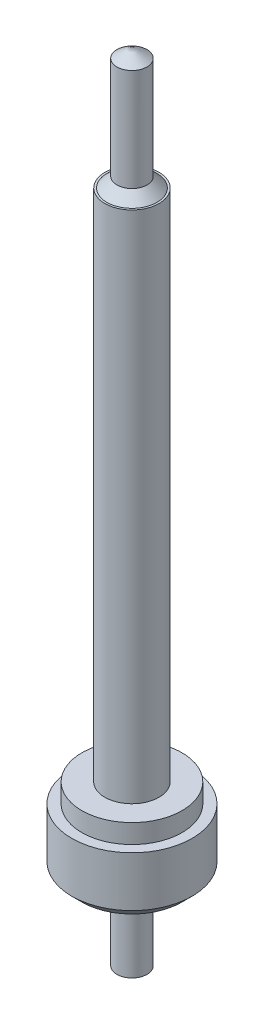
ISO-10303-21;
HEADER;
FILE_DESCRIPTION(('STEP AP214'),'2;1');
FILE_NAME('part.step','',(''),(''),'','','');
FILE_SCHEMA(('AUTOMOTIVE_DESIGN { 1 0 10303 214 1 1 1 1 }'));
ENDSEC;
DATA;
#1=APPLICATION_CONTEXT('core data for automotive mechanical design processes');
#2=APPLICATION_PROTOCOL_DEFINITION('international standard','automotive_design',2000,#1);
#3=PRODUCT_CONTEXT('',#1,'mechanical');
#4=PRODUCT('Part','Part','',(#3));
#5=PRODUCT_RELATED_PRODUCT_CATEGORY('part','',(#4));
#6=PRODUCT_DEFINITION_FORMATION('','',#4);
#7=PRODUCT_DEFINITION_CONTEXT('part definition',#1,'design');
#8=PRODUCT_DEFINITION('design','',#6,#7);
#9=PRODUCT_DEFINITION_SHAPE('','',#8);
#10=(LENGTH_UNIT() NAMED_UNIT(*) SI_UNIT(.MILLI.,.METRE.));
#11=(NAMED_UNIT(*) PLANE_ANGLE_UNIT() SI_UNIT($,.RADIAN.));
#12=(NAMED_UNIT(*) SI_UNIT($,.STERADIAN.) SOLID_ANGLE_UNIT());
#13=UNCERTAINTY_MEASURE_WITH_UNIT(LENGTH_MEASURE(1.E-05),#10,'distance_accuracy_value','');
#14=(GEOMETRIC_REPRESENTATION_CONTEXT(3) GLOBAL_UNCERTAINTY_ASSIGNED_CONTEXT((#13)) GLOBAL_UNIT_ASSIGNED_CONTEXT((#10,
#11,#12)) REPRESENTATION_CONTEXT('',''));
#15=CARTESIAN_POINT('',(0.,0.,0.));
#16=DIRECTION('',(0.,0.,1.));
#17=DIRECTION('',(1.,0.,0.));
#18=AXIS2_PLACEMENT_3D('',#15,#16,#17);
#19=CARTESIAN_POINT('',(0.,-0.3,0.));
#20=DIRECTION('',(0.,1.,0.));
#21=DIRECTION('',(0.,0.,1.));
#22=AXIS2_PLACEMENT_3D('',#19,#20,#21);
#23=CYLINDRICAL_SURFACE('',#22,0.3);
#24=CARTESIAN_POINT('',(0.,-0.25,0.));
#25=DIRECTION('',(0.,1.,0.));
#26=DIRECTION('',(0.,0.,1.));
#27=AXIS2_PLACEMENT_3D('',#24,#25,#26);
#28=CIRCLE('',#27,0.3);
#29=CARTESIAN_POINT('',(0.,-0.25,0.3));
#30=VERTEX_POINT('',#29);
#31=EDGE_CURVE('E86',#30,#30,#28,.T.);
#32=ORIENTED_EDGE('',*,*,#31,.T.);
#33=EDGE_LOOP('',(#32));
#34=FACE_BOUND('',#33,.T.);
#35=CARTESIAN_POINT('',(0.,0.,0.));
#36=DIRECTION('',(0.,1.,0.));
#37=DIRECTION('',(0.,0.,1.));
#38=AXIS2_PLACEMENT_3D('',#35,#36,#37);
#39=CIRCLE('',#38,0.3);
#40=CARTESIAN_POINT('',(0.,0.,0.3));
#41=VERTEX_POINT('',#40);
#42=EDGE_CURVE('E137',#41,#41,#39,.T.);
#43=ORIENTED_EDGE('',*,*,#42,.F.);
#44=EDGE_LOOP('',(#43));
#45=FACE_BOUND('',#44,.T.);
#46=ADVANCED_FACE('F35',(#34,#45),#23,.T.);
#47=CARTESIAN_POINT('',(0.,-0.3,0.));
#48=DIRECTION('',(0.,1.,0.));
#49=DIRECTION('',(0.,0.,1.));
#50=AXIS2_PLACEMENT_3D('',#47,#48,#49);
#51=PLANE('',#50);
#52=CARTESIAN_POINT('',(0.,-0.3,0.));
#53=DIRECTION('',(0.,1.,0.));
#54=DIRECTION('',(0.,0.,1.));
#55=AXIS2_PLACEMENT_3D('',#52,#53,#54);
#56=CIRCLE('',#55,0.25);
#57=CARTESIAN_POINT('',(0.,-0.3,0.25));
#58=VERTEX_POINT('',#57);
#59=EDGE_CURVE('E84',#58,#58,#56,.F.);
#60=ORIENTED_EDGE('',*,*,#59,.T.);
#61=EDGE_LOOP('',(#60));
#62=FACE_BOUND('',#61,.T.);
#63=CARTESIAN_POINT('',(0.,-0.3,0.));
#64=DIRECTION('',(0.,1.,0.));
#65=DIRECTION('',(0.,0.,1.));
#66=AXIS2_PLACEMENT_3D('',#63,#64,#65);
#67=CIRCLE('',#66,0.075);
#68=CARTESIAN_POINT('',(0.,-0.3,0.075));
#69=VERTEX_POINT('',#68);
#70=EDGE_CURVE('E92',#69,#69,#67,.F.);
#71=ORIENTED_EDGE('',*,*,#70,.F.);
#72=EDGE_LOOP('',(#71));
#73=FACE_BOUND('',#72,.T.);
#74=ADVANCED_FACE('F59',(#62,#73),#51,.F.);
#75=CARTESIAN_POINT('',(0.,0.,0.));
#76=DIRECTION('',(0.,1.,0.));
#77=DIRECTION('',(0.,0.,1.));
#78=AXIS2_PLACEMENT_3D('',#75,#76,#77);
#79=PLANE('',#78);
#80=CARTESIAN_POINT('',(0.,0.,0.));
#81=DIRECTION('',(0.,1.,0.));
#82=DIRECTION('',(0.,0.,1.));
#83=AXIS2_PLACEMENT_3D('',#80,#81,#82);
#84=CIRCLE('',#83,0.25);
#85=CARTESIAN_POINT('',(0.,0.,0.25));
#86=VERTEX_POINT('',#85);
#87=EDGE_CURVE('E142',#86,#86,#84,.T.);
#88=ORIENTED_EDGE('',*,*,#87,.F.);
#89=EDGE_LOOP('',(#88));
#90=FACE_BOUND('',#89,.T.);
#91=ORIENTED_EDGE('',*,*,#42,.T.);
#92=EDGE_LOOP('',(#91));
#93=FACE_BOUND('',#92,.T.);
#94=ADVANCED_FACE('F65',(#90,#93),#79,.T.);
#95=CARTESIAN_POINT('',(0.,-0.75,0.));
#96=DIRECTION('',(0.,1.,0.));
#97=DIRECTION('',(0.,0.,1.));
#98=AXIS2_PLACEMENT_3D('',#95,#96,#97);
#99=CYLINDRICAL_SURFACE('',#98,0.075);
#100=CARTESIAN_POINT('',(0.,-0.699999999999999,0.));
#101=DIRECTION('',(0.,-1.,0.));
#102=DIRECTION('',(0.,0.,-1.));
#103=AXIS2_PLACEMENT_3D('',#100,#101,#102);
#104=CIRCLE('',#103,0.075);
#105=CARTESIAN_POINT('',(0.,-0.699999999999999,-0.075));
#106=VERTEX_POINT('',#105);
#107=EDGE_CURVE('E87',#106,#106,#104,.F.);
#108=ORIENTED_EDGE('',*,*,#107,.T.);
#109=EDGE_LOOP('',(#108));
#110=FACE_BOUND('',#109,.T.);
#111=ORIENTED_EDGE('',*,*,#70,.T.);
#112=EDGE_LOOP('',(#111));
#113=FACE_BOUND('',#112,.T.);
#114=ADVANCED_FACE('F124',(#110,#113),#99,.T.);
#115=CARTESIAN_POINT('',(0.,0.095,0.));
#116=DIRECTION('',(0.,-1.,0.));
#117=DIRECTION('',(0.,0.,-1.));
#118=AXIS2_PLACEMENT_3D('',#115,#116,#117);
#119=CYLINDRICAL_SURFACE('',#118,0.25);
#120=CARTESIAN_POINT('',(0.,0.095,0.));
#121=DIRECTION('',(0.,1.,0.));
#122=DIRECTION('',(0.,0.,1.));
#123=AXIS2_PLACEMENT_3D('',#120,#121,#122);
#124=CIRCLE('',#123,0.25);
#125=CARTESIAN_POINT('',(0.,0.095,0.25));
#126=VERTEX_POINT('',#125);
#127=EDGE_CURVE('E139',#126,#126,#124,.T.);
#128=ORIENTED_EDGE('',*,*,#127,.F.);
#129=EDGE_LOOP('',(#128));
#130=FACE_BOUND('',#129,.T.);
#131=ORIENTED_EDGE('',*,*,#87,.T.);
#132=EDGE_LOOP('',(#131));
#133=FACE_BOUND('',#132,.T.);
#134=ADVANCED_FACE('F120',(#130,#133),#119,.T.);
#135=CARTESIAN_POINT('',(0.,0.095,0.));
#136=DIRECTION('',(0.,1.,0.));
#137=DIRECTION('',(0.,0.,1.));
#138=AXIS2_PLACEMENT_3D('',#135,#136,#137);
#139=PLANE('',#138);
#140=CARTESIAN_POINT('',(0.,0.095,0.));
#141=DIRECTION('',(0.,1.,0.));
#142=DIRECTION('',(0.,0.,1.));
#143=AXIS2_PLACEMENT_3D('',#140,#141,#142);
#144=CIRCLE('',#143,0.135);
#145=CARTESIAN_POINT('',(0.,0.095,0.135));
#146=VERTEX_POINT('',#145);
#147=EDGE_CURVE('E148',#146,#146,#144,.T.);
#148=ORIENTED_EDGE('',*,*,#147,.F.);
#149=EDGE_LOOP('',(#148));
#150=FACE_BOUND('',#149,.T.);
#151=ORIENTED_EDGE('',*,*,#127,.T.);
#152=EDGE_LOOP('',(#151));
#153=FACE_BOUND('',#152,.T.);
#154=ADVANCED_FACE('F116',(#150,#153),#139,.T.);
#155=CARTESIAN_POINT('',(0.,2.66,0.));
#156=DIRECTION('',(0.,-1.,0.));
#157=DIRECTION('',(0.,0.,-1.));
#158=AXIS2_PLACEMENT_3D('',#155,#156,#157);
#159=CYLINDRICAL_SURFACE('',#158,0.135);
#160=CARTESIAN_POINT('',(0.,2.66,0.));
#161=DIRECTION('',(0.,1.,0.));
#162=DIRECTION('',(0.,0.,1.));
#163=AXIS2_PLACEMENT_3D('',#160,#161,#162);
#164=CIRCLE('',#163,0.135);
#165=CARTESIAN_POINT('',(0.,2.66,0.135));
#166=VERTEX_POINT('',#165);
#167=EDGE_CURVE('E145',#166,#166,#164,.T.);
#168=ORIENTED_EDGE('',*,*,#167,.F.);
#169=EDGE_LOOP('',(#168));
#170=FACE_BOUND('',#169,.T.);
#171=ORIENTED_EDGE('',*,*,#147,.T.);
#172=EDGE_LOOP('',(#171));
#173=FACE_BOUND('',#172,.T.);
#174=ADVANCED_FACE('F111',(#170,#173),#159,.T.);
#175=CARTESIAN_POINT('',(0.,2.66,0.));
#176=DIRECTION('',(0.,1.,0.));
#177=DIRECTION('',(0.,0.,1.));
#178=AXIS2_PLACEMENT_3D('',#175,#176,#177);
#179=PLANE('',#178);
#180=CARTESIAN_POINT('',(0.,2.66,0.));
#181=DIRECTION('',(0.,1.,0.));
#182=DIRECTION('',(0.,0.,1.));
#183=AXIS2_PLACEMENT_3D('',#180,#181,#182);
#184=CIRCLE('',#183,0.125);
#185=CARTESIAN_POINT('',(0.,2.66,0.125));
#186=VERTEX_POINT('',#185);
#187=EDGE_CURVE('E44',#186,#186,#184,.F.);
#188=ORIENTED_EDGE('',*,*,#187,.T.);
#189=EDGE_LOOP('',(#188));
#190=FACE_BOUND('',#189,.T.);
#191=ORIENTED_EDGE('',*,*,#167,.T.);
#192=EDGE_LOOP('',(#191));
#193=FACE_BOUND('',#192,.T.);
#194=ADVANCED_FACE('F100',(#190,#193),#179,.T.);
#195=CARTESIAN_POINT('',(0.,3.27,0.));
#196=DIRECTION('',(0.,-1.,0.));
#197=DIRECTION('',(0.,0.,-1.));
#198=AXIS2_PLACEMENT_3D('',#195,#196,#197);
#199=CYLINDRICAL_SURFACE('',#198,0.075);
#200=CARTESIAN_POINT('',(0.,3.22,0.));
#201=DIRECTION('',(0.,1.,0.));
#202=DIRECTION('',(0.,0.,1.));
#203=AXIS2_PLACEMENT_3D('',#200,#201,#202);
#204=CIRCLE('',#203,0.075);
#205=CARTESIAN_POINT('',(0.,3.22,0.075));
#206=VERTEX_POINT('',#205);
#207=EDGE_CURVE('E11',#206,#206,#204,.F.);
#208=ORIENTED_EDGE('',*,*,#207,.T.);
#209=EDGE_LOOP('',(#208));
#210=FACE_BOUND('',#209,.T.);
#211=CARTESIAN_POINT('',(0.,2.71,0.));
#212=DIRECTION('',(0.,1.,0.));
#213=DIRECTION('',(0.,0.,1.));
#214=AXIS2_PLACEMENT_3D('',#211,#212,#213);
#215=CIRCLE('',#214,0.075);
#216=CARTESIAN_POINT('',(0.,2.71,0.075));
#217=VERTEX_POINT('',#216);
#218=EDGE_CURVE('E89',#217,#217,#215,.T.);
#219=ORIENTED_EDGE('',*,*,#218,.T.);
#220=EDGE_LOOP('',(#219));
#221=FACE_BOUND('',#220,.T.);
#222=ADVANCED_FACE('F75',(#210,#221),#199,.T.);
#223=CARTESIAN_POINT('',(0.,-0.699999999999999,0.));
#224=DIRECTION('',(0.,1.,0.));
#225=DIRECTION('',(0.,0.,1.));
#226=AXIS2_PLACEMENT_3D('',#223,#224,#225);
#227=CONICAL_SURFACE('',#226,0.0750000000000009,0.982793723247327);
#228=ORIENTED_EDGE('',*,*,#107,.F.);
#229=EDGE_LOOP('',(#228));
#230=FACE_BOUND('',#229,.T.);
#231=CARTESIAN_POINT('',(0.,-0.75,0.));
#232=VERTEX_POINT('',#231);
#233=VERTEX_LOOP('',#232);
#234=FACE_BOUND('',#233,.T.);
#235=ADVANCED_FACE('F72',(#230,#234),#227,.T.);
#236=CARTESIAN_POINT('',(0.,-0.25,0.));
#237=DIRECTION('',(0.,1.,0.));
#238=DIRECTION('',(0.,0.,1.));
#239=AXIS2_PLACEMENT_3D('',#236,#237,#238);
#240=CONICAL_SURFACE('',#239,0.3,0.785398163397449);
#241=ORIENTED_EDGE('',*,*,#59,.F.);
#242=EDGE_LOOP('',(#241));
#243=FACE_BOUND('',#242,.T.);
#244=ORIENTED_EDGE('',*,*,#31,.F.);
#245=EDGE_LOOP('',(#244));
#246=FACE_BOUND('',#245,.T.);
#247=ADVANCED_FACE('F55',(#243,#246),#240,.T.);
#248=CARTESIAN_POINT('',(0.,2.71,0.));
#249=DIRECTION('',(0.,-1.,0.));
#250=DIRECTION('',(0.,0.,-1.));
#251=AXIS2_PLACEMENT_3D('',#248,#249,#250);
#252=CONICAL_SURFACE('',#251,0.075,0.785398163397448);
#253=ORIENTED_EDGE('',*,*,#187,.F.);
#254=EDGE_LOOP('',(#253));
#255=FACE_BOUND('',#254,.T.);
#256=ORIENTED_EDGE('',*,*,#218,.F.);
#257=EDGE_LOOP('',(#256));
#258=FACE_BOUND('',#257,.T.);
#259=ADVANCED_FACE('F50',(#255,#258),#252,.T.);
#260=CARTESIAN_POINT('',(0.,3.22,0.));
#261=DIRECTION('',(0.,-1.,0.));
#262=DIRECTION('',(0.,0.,-1.));
#263=AXIS2_PLACEMENT_3D('',#260,#261,#262);
#264=CONICAL_SURFACE('',#263,0.0750000000000017,0.982793723247334);
#265=ORIENTED_EDGE('',*,*,#207,.F.);
#266=EDGE_LOOP('',(#265));
#267=FACE_BOUND('',#266,.T.);
#268=CARTESIAN_POINT('',(0.,3.27,0.));
#269=VERTEX_POINT('',#268);
#270=VERTEX_LOOP('',#269);
#271=FACE_BOUND('',#270,.T.);
#272=ADVANCED_FACE('F37',(#267,#271),#264,.T.);
#273=CLOSED_SHELL('',(#46,#74,#94,#114,#134,#154,#174,#194,#222,#235,#247,#259,#272));
#274=MANIFOLD_SOLID_BREP('B2',#273);
#275=ADVANCED_BREP_SHAPE_REPRESENTATION('',(#18,#274),#14);
#276=SHAPE_DEFINITION_REPRESENTATION(#9,#275);
ENDSEC;
END-ISO-10303-21;
